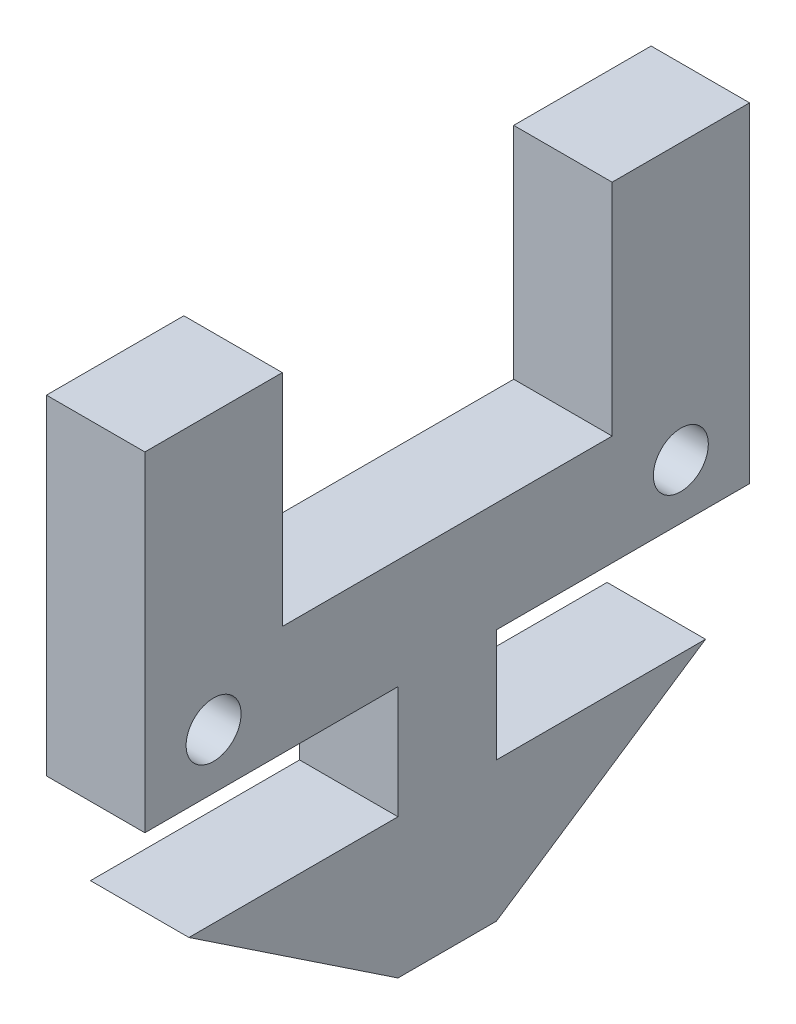
ISO-10303-21;
HEADER;
FILE_DESCRIPTION(('STEP AP214'),'2;1');
FILE_NAME('part.step','',(''),(''),'','','');
FILE_SCHEMA(('AUTOMOTIVE_DESIGN { 1 0 10303 214 1 1 1 1 }'));
ENDSEC;
DATA;
#1=APPLICATION_CONTEXT('core data for automotive mechanical design processes');
#2=APPLICATION_PROTOCOL_DEFINITION('international standard','automotive_design',2000,#1);
#3=PRODUCT_CONTEXT('',#1,'mechanical');
#4=PRODUCT('Part','Part','',(#3));
#5=PRODUCT_RELATED_PRODUCT_CATEGORY('part','',(#4));
#6=PRODUCT_DEFINITION_FORMATION('','',#4);
#7=PRODUCT_DEFINITION_CONTEXT('part definition',#1,'design');
#8=PRODUCT_DEFINITION('design','',#6,#7);
#9=PRODUCT_DEFINITION_SHAPE('','',#8);
#10=(LENGTH_UNIT() NAMED_UNIT(*) SI_UNIT(.MILLI.,.METRE.));
#11=(NAMED_UNIT(*) PLANE_ANGLE_UNIT() SI_UNIT($,.RADIAN.));
#12=(NAMED_UNIT(*) SI_UNIT($,.STERADIAN.) SOLID_ANGLE_UNIT());
#13=UNCERTAINTY_MEASURE_WITH_UNIT(LENGTH_MEASURE(1.E-05),#10,'distance_accuracy_value','');
#14=(GEOMETRIC_REPRESENTATION_CONTEXT(3) GLOBAL_UNCERTAINTY_ASSIGNED_CONTEXT((#13)) GLOBAL_UNIT_ASSIGNED_CONTEXT((#10,
#11,#12)) REPRESENTATION_CONTEXT('',''));
#15=CARTESIAN_POINT('',(0.,0.,0.));
#16=DIRECTION('',(0.,0.,1.));
#17=DIRECTION('',(1.,0.,0.));
#18=AXIS2_PLACEMENT_3D('',#15,#16,#17);
#19=CARTESIAN_POINT('',(3.5814,-6.,11.));
#20=DIRECTION('',(0.,1.,0.));
#21=DIRECTION('',(0.,0.,1.));
#22=AXIS2_PLACEMENT_3D('',#19,#20,#21);
#23=PLANE('',#22);
#24=DIRECTION('',(-1.,0.,0.));
#25=VECTOR('',#24,1.);
#26=CARTESIAN_POINT('',(24.4993830767691,-6.,1.7907));
#27=LINE('',#26,#25);
#28=CARTESIAN_POINT('',(3.5814,-6.,1.7907));
#29=VERTEX_POINT('',#28);
#30=CARTESIAN_POINT('',(0.,-6.,1.7907));
#31=VERTEX_POINT('',#30);
#32=EDGE_CURVE('E57',#29,#31,#27,.T.);
#33=ORIENTED_EDGE('',*,*,#32,.F.);
#34=DIRECTION('',(0.,0.,-1.));
#35=VECTOR('',#34,1.);
#36=CARTESIAN_POINT('',(3.5814,-6.,11.));
#37=LINE('',#36,#35);
#38=CARTESIAN_POINT('',(3.5814,-6.,11.));
#39=VERTEX_POINT('',#38);
#40=EDGE_CURVE('E231',#39,#29,#37,.T.);
#41=ORIENTED_EDGE('',*,*,#40,.F.);
#42=DIRECTION('',(-1.,0.,0.));
#43=VECTOR('',#42,1.);
#44=CARTESIAN_POINT('',(3.5814,-6.,11.));
#45=LINE('',#44,#43);
#46=CARTESIAN_POINT('',(0.,-6.,11.));
#47=VERTEX_POINT('',#46);
#48=EDGE_CURVE('E257',#39,#47,#45,.T.);
#49=ORIENTED_EDGE('',*,*,#48,.T.);
#50=DIRECTION('',(0.,0.,-1.));
#51=VECTOR('',#50,1.);
#52=CARTESIAN_POINT('',(0.,-6.,11.));
#53=LINE('',#52,#51);
#54=EDGE_CURVE('E249',#47,#31,#53,.T.);
#55=ORIENTED_EDGE('',*,*,#54,.T.);
#56=EDGE_LOOP('',(#33,#41,#49,#55));
#57=FACE_BOUND('',#56,.T.);
#58=ADVANCED_FACE('F34',(#57),#23,.F.);
#59=CARTESIAN_POINT('',(3.5814,6.,-6.));
#60=DIRECTION('',(0.,-1.,0.));
#61=DIRECTION('',(0.,0.,-1.));
#62=AXIS2_PLACEMENT_3D('',#59,#60,#61);
#63=PLANE('',#62);
#64=DIRECTION('',(0.,0.,1.));
#65=VECTOR('',#64,1.);
#66=CARTESIAN_POINT('',(0.,6.,-6.));
#67=LINE('',#66,#65);
#68=CARTESIAN_POINT('',(0.,6.,-11.));
#69=VERTEX_POINT('',#68);
#70=CARTESIAN_POINT('',(0.,6.,-6.));
#71=VERTEX_POINT('',#70);
#72=EDGE_CURVE('E212',#69,#71,#67,.T.);
#73=ORIENTED_EDGE('',*,*,#72,.T.);
#74=DIRECTION('',(-1.,0.,0.));
#75=VECTOR('',#74,1.);
#76=CARTESIAN_POINT('',(3.5814,6.,-6.));
#77=LINE('',#76,#75);
#78=CARTESIAN_POINT('',(3.5814,6.,-6.));
#79=VERTEX_POINT('',#78);
#80=EDGE_CURVE('E11',#79,#71,#77,.T.);
#81=ORIENTED_EDGE('',*,*,#80,.F.);
#82=DIRECTION('',(0.,0.,1.));
#83=VECTOR('',#82,1.);
#84=CARTESIAN_POINT('',(3.5814,6.,-6.));
#85=LINE('',#84,#83);
#86=CARTESIAN_POINT('',(3.5814,6.,-11.));
#87=VERTEX_POINT('',#86);
#88=EDGE_CURVE('E218',#87,#79,#85,.T.);
#89=ORIENTED_EDGE('',*,*,#88,.F.);
#90=DIRECTION('',(-1.,0.,0.));
#91=VECTOR('',#90,1.);
#92=CARTESIAN_POINT('',(3.5814,6.,-11.));
#93=LINE('',#92,#91);
#94=EDGE_CURVE('E235',#87,#69,#93,.T.);
#95=ORIENTED_EDGE('',*,*,#94,.T.);
#96=EDGE_LOOP('',(#73,#81,#89,#95));
#97=FACE_BOUND('',#96,.T.);
#98=ADVANCED_FACE('F36',(#97),#63,.F.);
#99=CARTESIAN_POINT('',(3.5814,-2.,-6.));
#100=DIRECTION('',(0.,0.,-1.));
#101=DIRECTION('',(0.,1.,0.));
#102=AXIS2_PLACEMENT_3D('',#99,#100,#101);
#103=PLANE('',#102);
#104=DIRECTION('',(0.,-1.,0.));
#105=VECTOR('',#104,1.);
#106=CARTESIAN_POINT('',(0.,-2.,-6.));
#107=LINE('',#106,#105);
#108=CARTESIAN_POINT('',(0.,-2.,-6.));
#109=VERTEX_POINT('',#108);
#110=EDGE_CURVE('E238',#71,#109,#107,.T.);
#111=ORIENTED_EDGE('',*,*,#110,.T.);
#112=DIRECTION('',(-1.,0.,0.));
#113=VECTOR('',#112,1.);
#114=CARTESIAN_POINT('',(3.5814,-2.,-6.));
#115=LINE('',#114,#113);
#116=CARTESIAN_POINT('',(3.5814,-2.,-6.));
#117=VERTEX_POINT('',#116);
#118=EDGE_CURVE('E42',#117,#109,#115,.T.);
#119=ORIENTED_EDGE('',*,*,#118,.F.);
#120=DIRECTION('',(0.,-1.,0.));
#121=VECTOR('',#120,1.);
#122=CARTESIAN_POINT('',(3.5814,-2.,-6.));
#123=LINE('',#122,#121);
#124=EDGE_CURVE('E220',#79,#117,#123,.T.);
#125=ORIENTED_EDGE('',*,*,#124,.F.);
#126=ORIENTED_EDGE('',*,*,#80,.T.);
#127=EDGE_LOOP('',(#111,#119,#125,#126));
#128=FACE_BOUND('',#127,.T.);
#129=ADVANCED_FACE('F294',(#128),#103,.F.);
#130=CARTESIAN_POINT('',(3.5814,-2.,6.));
#131=DIRECTION('',(0.,-1.,0.));
#132=DIRECTION('',(0.,0.,-1.));
#133=AXIS2_PLACEMENT_3D('',#130,#131,#132);
#134=PLANE('',#133);
#135=DIRECTION('',(0.,0.,1.));
#136=VECTOR('',#135,1.);
#137=CARTESIAN_POINT('',(0.,-2.,6.));
#138=LINE('',#137,#136);
#139=CARTESIAN_POINT('',(0.,-2.,6.));
#140=VERTEX_POINT('',#139);
#141=EDGE_CURVE('E240',#109,#140,#138,.T.);
#142=ORIENTED_EDGE('',*,*,#141,.T.);
#143=DIRECTION('',(-1.,0.,0.));
#144=VECTOR('',#143,1.);
#145=CARTESIAN_POINT('',(3.5814,-2.,6.));
#146=LINE('',#145,#144);
#147=CARTESIAN_POINT('',(3.5814,-2.,6.));
#148=VERTEX_POINT('',#147);
#149=EDGE_CURVE('E266',#148,#140,#146,.T.);
#150=ORIENTED_EDGE('',*,*,#149,.F.);
#151=DIRECTION('',(0.,0.,1.));
#152=VECTOR('',#151,1.);
#153=CARTESIAN_POINT('',(3.5814,-2.,6.));
#154=LINE('',#153,#152);
#155=EDGE_CURVE('E223',#117,#148,#154,.T.);
#156=ORIENTED_EDGE('',*,*,#155,.F.);
#157=ORIENTED_EDGE('',*,*,#118,.T.);
#158=EDGE_LOOP('',(#142,#150,#156,#157));
#159=FACE_BOUND('',#158,.T.);
#160=ADVANCED_FACE('F273',(#159),#134,.F.);
#161=CARTESIAN_POINT('',(3.5814,6.,6.));
#162=DIRECTION('',(0.,0.,1.));
#163=DIRECTION('',(0.,-1.,0.));
#164=AXIS2_PLACEMENT_3D('',#161,#162,#163);
#165=PLANE('',#164);
#166=DIRECTION('',(0.,1.,0.));
#167=VECTOR('',#166,1.);
#168=CARTESIAN_POINT('',(0.,6.,6.));
#169=LINE('',#168,#167);
#170=CARTESIAN_POINT('',(0.,6.,6.));
#171=VERTEX_POINT('',#170);
#172=EDGE_CURVE('E242',#140,#171,#169,.T.);
#173=ORIENTED_EDGE('',*,*,#172,.T.);
#174=DIRECTION('',(-1.,0.,0.));
#175=VECTOR('',#174,1.);
#176=CARTESIAN_POINT('',(3.5814,6.,6.));
#177=LINE('',#176,#175);
#178=CARTESIAN_POINT('',(3.5814,6.,6.));
#179=VERTEX_POINT('',#178);
#180=EDGE_CURVE('E263',#179,#171,#177,.T.);
#181=ORIENTED_EDGE('',*,*,#180,.F.);
#182=DIRECTION('',(0.,1.,0.));
#183=VECTOR('',#182,1.);
#184=CARTESIAN_POINT('',(3.5814,6.,6.));
#185=LINE('',#184,#183);
#186=EDGE_CURVE('E225',#148,#179,#185,.T.);
#187=ORIENTED_EDGE('',*,*,#186,.F.);
#188=ORIENTED_EDGE('',*,*,#149,.T.);
#189=EDGE_LOOP('',(#173,#181,#187,#188));
#190=FACE_BOUND('',#189,.T.);
#191=ADVANCED_FACE('F284',(#190),#165,.F.);
#192=CARTESIAN_POINT('',(3.5814,6.,11.));
#193=DIRECTION('',(0.,-1.,0.));
#194=DIRECTION('',(0.,0.,-1.));
#195=AXIS2_PLACEMENT_3D('',#192,#193,#194);
#196=PLANE('',#195);
#197=DIRECTION('',(0.,0.,1.));
#198=VECTOR('',#197,1.);
#199=CARTESIAN_POINT('',(0.,6.,11.));
#200=LINE('',#199,#198);
#201=CARTESIAN_POINT('',(0.,6.,11.));
#202=VERTEX_POINT('',#201);
#203=EDGE_CURVE('E244',#171,#202,#200,.T.);
#204=ORIENTED_EDGE('',*,*,#203,.T.);
#205=DIRECTION('',(-1.,0.,0.));
#206=VECTOR('',#205,1.);
#207=CARTESIAN_POINT('',(3.5814,6.,11.));
#208=LINE('',#207,#206);
#209=CARTESIAN_POINT('',(3.5814,6.,11.));
#210=VERTEX_POINT('',#209);
#211=EDGE_CURVE('E260',#210,#202,#208,.T.);
#212=ORIENTED_EDGE('',*,*,#211,.F.);
#213=DIRECTION('',(0.,0.,1.));
#214=VECTOR('',#213,1.);
#215=CARTESIAN_POINT('',(3.5814,6.,11.));
#216=LINE('',#215,#214);
#217=EDGE_CURVE('E227',#179,#210,#216,.T.);
#218=ORIENTED_EDGE('',*,*,#217,.F.);
#219=ORIENTED_EDGE('',*,*,#180,.T.);
#220=EDGE_LOOP('',(#204,#212,#218,#219));
#221=FACE_BOUND('',#220,.T.);
#222=ADVANCED_FACE('F288',(#221),#196,.F.);
#223=CARTESIAN_POINT('',(3.5814,-6.,11.));
#224=DIRECTION('',(0.,0.,-1.));
#225=DIRECTION('',(-1.,0.,0.));
#226=AXIS2_PLACEMENT_3D('',#223,#224,#225);
#227=PLANE('',#226);
#228=DIRECTION('',(0.,-1.,0.));
#229=VECTOR('',#228,1.);
#230=CARTESIAN_POINT('',(0.,-6.,11.));
#231=LINE('',#230,#229);
#232=EDGE_CURVE('E246',#202,#47,#231,.T.);
#233=ORIENTED_EDGE('',*,*,#232,.T.);
#234=ORIENTED_EDGE('',*,*,#48,.F.);
#235=DIRECTION('',(0.,-1.,0.));
#236=VECTOR('',#235,1.);
#237=CARTESIAN_POINT('',(3.5814,-6.,11.));
#238=LINE('',#237,#236);
#239=EDGE_CURVE('E229',#210,#39,#238,.T.);
#240=ORIENTED_EDGE('',*,*,#239,.F.);
#241=ORIENTED_EDGE('',*,*,#211,.T.);
#242=EDGE_LOOP('',(#233,#234,#240,#241));
#243=FACE_BOUND('',#242,.T.);
#244=ADVANCED_FACE('F334',(#243),#227,.F.);
#245=CARTESIAN_POINT('',(3.5814,-6.,-1.7907));
#246=VERTEX_POINT('',#245);
#247=CARTESIAN_POINT('',(3.5814,-6.,-11.));
#248=VERTEX_POINT('',#247);
#249=EDGE_CURVE('E49',#246,#248,#37,.T.);
#250=ORIENTED_EDGE('',*,*,#249,.F.);
#251=DIRECTION('',(-1.,0.,0.));
#252=VECTOR('',#251,1.);
#253=CARTESIAN_POINT('',(24.4993830767691,-6.,-1.7907));
#254=LINE('',#253,#252);
#255=CARTESIAN_POINT('',(0.,-6.,-1.7907));
#256=VERTEX_POINT('',#255);
#257=EDGE_CURVE('E196',#246,#256,#254,.T.);
#258=ORIENTED_EDGE('',*,*,#257,.T.);
#259=CARTESIAN_POINT('',(0.,-6.,-11.));
#260=VERTEX_POINT('',#259);
#261=EDGE_CURVE('E248',#256,#260,#53,.T.);
#262=ORIENTED_EDGE('',*,*,#261,.T.);
#263=DIRECTION('',(-1.,0.,0.));
#264=VECTOR('',#263,1.);
#265=CARTESIAN_POINT('',(3.5814,-6.,-11.));
#266=LINE('',#265,#264);
#267=EDGE_CURVE('E254',#248,#260,#266,.T.);
#268=ORIENTED_EDGE('',*,*,#267,.F.);
#269=EDGE_LOOP('',(#250,#258,#262,#268));
#270=FACE_BOUND('',#269,.T.);
#271=ADVANCED_FACE('F304',(#270),#23,.F.);
#272=CARTESIAN_POINT('',(3.5814,-6.,-11.));
#273=DIRECTION('',(0.,0.,1.));
#274=DIRECTION('',(1.,0.,0.));
#275=AXIS2_PLACEMENT_3D('',#272,#273,#274);
#276=PLANE('',#275);
#277=DIRECTION('',(0.,1.,0.));
#278=VECTOR('',#277,1.);
#279=CARTESIAN_POINT('',(0.,-6.,-11.));
#280=LINE('',#279,#278);
#281=EDGE_CURVE('E221',#260,#69,#280,.T.);
#282=ORIENTED_EDGE('',*,*,#281,.T.);
#283=ORIENTED_EDGE('',*,*,#94,.F.);
#284=DIRECTION('',(0.,1.,0.));
#285=VECTOR('',#284,1.);
#286=CARTESIAN_POINT('',(3.5814,-6.,-11.));
#287=LINE('',#286,#285);
#288=EDGE_CURVE('E233',#248,#87,#287,.T.);
#289=ORIENTED_EDGE('',*,*,#288,.F.);
#290=ORIENTED_EDGE('',*,*,#267,.T.);
#291=EDGE_LOOP('',(#282,#283,#289,#290));
#292=FACE_BOUND('',#291,.T.);
#293=ADVANCED_FACE('F302',(#292),#276,.F.);
#294=CARTESIAN_POINT('',(3.5814,0.,0.));
#295=DIRECTION('',(1.,0.,0.));
#296=DIRECTION('',(0.,0.,-1.));
#297=AXIS2_PLACEMENT_3D('',#294,#295,#296);
#298=PLANE('',#297);
#299=CARTESIAN_POINT('',(3.5814,-4.,8.5));
#300=DIRECTION('',(1.,0.,0.));
#301=DIRECTION('',(0.,0.,-1.));
#302=AXIS2_PLACEMENT_3D('',#299,#300,#301);
#303=CIRCLE('',#302,1.);
#304=CARTESIAN_POINT('',(3.5814,-4.,7.5));
#305=VERTEX_POINT('',#304);
#306=EDGE_CURVE('E213',#305,#305,#303,.T.);
#307=ORIENTED_EDGE('',*,*,#306,.F.);
#308=EDGE_LOOP('',(#307));
#309=FACE_BOUND('',#308,.T.);
#310=CARTESIAN_POINT('',(3.5814,-4.,-8.5));
#311=DIRECTION('',(1.,0.,0.));
#312=DIRECTION('',(0.,0.,-1.));
#313=AXIS2_PLACEMENT_3D('',#310,#311,#312);
#314=CIRCLE('',#313,1.);
#315=CARTESIAN_POINT('',(3.5814,-4.,-9.5));
#316=VERTEX_POINT('',#315);
#317=EDGE_CURVE('E174',#316,#316,#314,.T.);
#318=ORIENTED_EDGE('',*,*,#317,.F.);
#319=EDGE_LOOP('',(#318));
#320=FACE_BOUND('',#319,.T.);
#321=ORIENTED_EDGE('',*,*,#88,.T.);
#322=ORIENTED_EDGE('',*,*,#124,.T.);
#323=ORIENTED_EDGE('',*,*,#155,.T.);
#324=ORIENTED_EDGE('',*,*,#186,.T.);
#325=ORIENTED_EDGE('',*,*,#217,.T.);
#326=ORIENTED_EDGE('',*,*,#239,.T.);
#327=ORIENTED_EDGE('',*,*,#40,.T.);
#328=DIRECTION('',(0.,-1.,0.));
#329=VECTOR('',#328,1.);
#330=CARTESIAN_POINT('',(3.5814,-6.,1.7907));
#331=LINE('',#330,#329);
#332=CARTESIAN_POINT('',(3.5814,-10.1,1.7907));
#333=VERTEX_POINT('',#332);
#334=EDGE_CURVE('E186',#29,#333,#331,.T.);
#335=ORIENTED_EDGE('',*,*,#334,.T.);
#336=DIRECTION('',(0.,0.,1.));
#337=VECTOR('',#336,1.);
#338=CARTESIAN_POINT('',(3.5814,-10.1,1.7907));
#339=LINE('',#338,#337);
#340=CARTESIAN_POINT('',(3.5814,-10.1,9.398));
#341=VERTEX_POINT('',#340);
#342=EDGE_CURVE('E179',#333,#341,#339,.T.);
#343=ORIENTED_EDGE('',*,*,#342,.T.);
#344=DIRECTION('',(0.,-0.555340809590661,-0.831622862362014));
#345=VECTOR('',#344,1.);
#346=CARTESIAN_POINT('',(3.5814,-10.1,9.398));
#347=LINE('',#346,#345);
#348=CARTESIAN_POINT('',(3.5814,-15.18,1.7907));
#349=VERTEX_POINT('',#348);
#350=EDGE_CURVE('E173',#341,#349,#347,.T.);
#351=ORIENTED_EDGE('',*,*,#350,.T.);
#352=DIRECTION('',(0.,0.,-1.));
#353=VECTOR('',#352,1.);
#354=CARTESIAN_POINT('',(3.5814,-15.18,1.7907));
#355=LINE('',#354,#353);
#356=CARTESIAN_POINT('',(3.5814,-15.18,-1.7907));
#357=VERTEX_POINT('',#356);
#358=EDGE_CURVE('E151',#349,#357,#355,.T.);
#359=ORIENTED_EDGE('',*,*,#358,.T.);
#360=DIRECTION('',(0.,0.555340809590661,-0.831622862362014));
#361=VECTOR('',#360,1.);
#362=CARTESIAN_POINT('',(3.5814,-15.18,-1.7907));
#363=LINE('',#362,#361);
#364=CARTESIAN_POINT('',(3.5814,-10.1,-9.398));
#365=VERTEX_POINT('',#364);
#366=EDGE_CURVE('E161',#357,#365,#363,.T.);
#367=ORIENTED_EDGE('',*,*,#366,.T.);
#368=DIRECTION('',(0.,0.,1.));
#369=VECTOR('',#368,1.);
#370=CARTESIAN_POINT('',(3.5814,-10.1,-9.398));
#371=LINE('',#370,#369);
#372=CARTESIAN_POINT('',(3.5814,-10.1,-1.7907));
#373=VERTEX_POINT('',#372);
#374=EDGE_CURVE('E167',#365,#373,#371,.T.);
#375=ORIENTED_EDGE('',*,*,#374,.T.);
#376=DIRECTION('',(0.,1.,0.));
#377=VECTOR('',#376,1.);
#378=CARTESIAN_POINT('',(3.5814,-6.,-1.7907));
#379=LINE('',#378,#377);
#380=EDGE_CURVE('E189',#373,#246,#379,.T.);
#381=ORIENTED_EDGE('',*,*,#380,.T.);
#382=ORIENTED_EDGE('',*,*,#249,.T.);
#383=ORIENTED_EDGE('',*,*,#288,.T.);
#384=EDGE_LOOP('',(#321,#322,#323,#324,#325,#326,#327,#335,#343,#351,#359,#367,#375,#381,#382,#383));
#385=FACE_BOUND('',#384,.T.);
#386=ADVANCED_FACE('F171',(#309,#320,#385),#298,.T.);
#387=CARTESIAN_POINT('',(0.,0.,0.));
#388=DIRECTION('',(1.,0.,0.));
#389=DIRECTION('',(0.,0.,-1.));
#390=AXIS2_PLACEMENT_3D('',#387,#388,#389);
#391=PLANE('',#390);
#392=CARTESIAN_POINT('',(0.,-4.,8.5));
#393=DIRECTION('',(1.,0.,0.));
#394=DIRECTION('',(0.,0.,-1.));
#395=AXIS2_PLACEMENT_3D('',#392,#393,#394);
#396=CIRCLE('',#395,1.);
#397=CARTESIAN_POINT('',(0.,-4.,7.5));
#398=VERTEX_POINT('',#397);
#399=EDGE_CURVE('E209',#398,#398,#396,.T.);
#400=ORIENTED_EDGE('',*,*,#399,.T.);
#401=EDGE_LOOP('',(#400));
#402=FACE_BOUND('',#401,.T.);
#403=CARTESIAN_POINT('',(0.,-4.,-8.5));
#404=DIRECTION('',(1.,0.,0.));
#405=DIRECTION('',(0.,0.,-1.));
#406=AXIS2_PLACEMENT_3D('',#403,#404,#405);
#407=CIRCLE('',#406,1.);
#408=CARTESIAN_POINT('',(0.,-4.,-9.5));
#409=VERTEX_POINT('',#408);
#410=EDGE_CURVE('E177',#409,#409,#407,.T.);
#411=ORIENTED_EDGE('',*,*,#410,.T.);
#412=EDGE_LOOP('',(#411));
#413=FACE_BOUND('',#412,.T.);
#414=ORIENTED_EDGE('',*,*,#72,.F.);
#415=ORIENTED_EDGE('',*,*,#281,.F.);
#416=ORIENTED_EDGE('',*,*,#261,.F.);
#417=DIRECTION('',(0.,1.,0.));
#418=VECTOR('',#417,1.);
#419=CARTESIAN_POINT('',(0.,-6.,-1.7907));
#420=LINE('',#419,#418);
#421=CARTESIAN_POINT('',(0.,-10.1,-1.7907));
#422=VERTEX_POINT('',#421);
#423=EDGE_CURVE('E195',#422,#256,#420,.T.);
#424=ORIENTED_EDGE('',*,*,#423,.F.);
#425=DIRECTION('',(0.,0.,1.));
#426=VECTOR('',#425,1.);
#427=CARTESIAN_POINT('',(0.,-10.1,-9.398));
#428=LINE('',#427,#426);
#429=CARTESIAN_POINT('',(0.,-10.1,-9.398));
#430=VERTEX_POINT('',#429);
#431=EDGE_CURVE('E182',#430,#422,#428,.T.);
#432=ORIENTED_EDGE('',*,*,#431,.F.);
#433=DIRECTION('',(0.,0.555340809590661,-0.831622862362014));
#434=VECTOR('',#433,1.);
#435=CARTESIAN_POINT('',(0.,-15.18,-1.7907));
#436=LINE('',#435,#434);
#437=CARTESIAN_POINT('',(0.,-15.18,-1.7907));
#438=VERTEX_POINT('',#437);
#439=EDGE_CURVE('E158',#438,#430,#436,.T.);
#440=ORIENTED_EDGE('',*,*,#439,.F.);
#441=DIRECTION('',(0.,0.,-1.));
#442=VECTOR('',#441,1.);
#443=CARTESIAN_POINT('',(0.,-15.18,1.7907));
#444=LINE('',#443,#442);
#445=CARTESIAN_POINT('',(0.,-15.18,1.7907));
#446=VERTEX_POINT('',#445);
#447=EDGE_CURVE('E154',#446,#438,#444,.T.);
#448=ORIENTED_EDGE('',*,*,#447,.F.);
#449=DIRECTION('',(0.,-0.555340809590661,-0.831622862362014));
#450=VECTOR('',#449,1.);
#451=CARTESIAN_POINT('',(0.,-10.1,9.398));
#452=LINE('',#451,#450);
#453=CARTESIAN_POINT('',(0.,-10.1,9.398));
#454=VERTEX_POINT('',#453);
#455=EDGE_CURVE('E205',#454,#446,#452,.T.);
#456=ORIENTED_EDGE('',*,*,#455,.F.);
#457=DIRECTION('',(0.,0.,1.));
#458=VECTOR('',#457,1.);
#459=CARTESIAN_POINT('',(0.,-10.1,1.7907));
#460=LINE('',#459,#458);
#461=CARTESIAN_POINT('',(0.,-10.1,1.7907));
#462=VERTEX_POINT('',#461);
#463=EDGE_CURVE('E202',#462,#454,#460,.T.);
#464=ORIENTED_EDGE('',*,*,#463,.F.);
#465=DIRECTION('',(0.,-1.,0.));
#466=VECTOR('',#465,1.);
#467=CARTESIAN_POINT('',(0.,-6.,1.7907));
#468=LINE('',#467,#466);
#469=EDGE_CURVE('E199',#31,#462,#468,.T.);
#470=ORIENTED_EDGE('',*,*,#469,.F.);
#471=ORIENTED_EDGE('',*,*,#54,.F.);
#472=ORIENTED_EDGE('',*,*,#232,.F.);
#473=ORIENTED_EDGE('',*,*,#203,.F.);
#474=ORIENTED_EDGE('',*,*,#172,.F.);
#475=ORIENTED_EDGE('',*,*,#141,.F.);
#476=ORIENTED_EDGE('',*,*,#110,.F.);
#477=EDGE_LOOP('',(#414,#415,#416,#424,#432,#440,#448,#456,#464,#470,#471,#472,#473,#474,#475,#476));
#478=FACE_BOUND('',#477,.T.);
#479=ADVANCED_FACE('F279',(#402,#413,#478),#391,.F.);
#480=CARTESIAN_POINT('',(0.,-4.,-8.5));
#481=DIRECTION('',(1.,0.,0.));
#482=DIRECTION('',(0.,0.,-1.));
#483=AXIS2_PLACEMENT_3D('',#480,#481,#482);
#484=CYLINDRICAL_SURFACE('',#483,1.);
#485=ORIENTED_EDGE('',*,*,#410,.F.);
#486=EDGE_LOOP('',(#485));
#487=FACE_BOUND('',#486,.T.);
#488=ORIENTED_EDGE('',*,*,#317,.T.);
#489=EDGE_LOOP('',(#488));
#490=FACE_BOUND('',#489,.T.);
#491=ADVANCED_FACE('F352',(#487,#490),#484,.F.);
#492=CARTESIAN_POINT('',(0.,-4.,8.5));
#493=DIRECTION('',(1.,0.,0.));
#494=DIRECTION('',(0.,0.,-1.));
#495=AXIS2_PLACEMENT_3D('',#492,#493,#494);
#496=CYLINDRICAL_SURFACE('',#495,1.);
#497=ORIENTED_EDGE('',*,*,#399,.F.);
#498=EDGE_LOOP('',(#497));
#499=FACE_BOUND('',#498,.T.);
#500=ORIENTED_EDGE('',*,*,#306,.T.);
#501=EDGE_LOOP('',(#500));
#502=FACE_BOUND('',#501,.T.);
#503=ADVANCED_FACE('F359',(#499,#502),#496,.F.);
#504=CARTESIAN_POINT('',(24.4993830767691,-10.1,-9.398));
#505=DIRECTION('',(0.,-1.,0.));
#506=DIRECTION('',(0.,0.,-1.));
#507=AXIS2_PLACEMENT_3D('',#504,#505,#506);
#508=PLANE('',#507);
#509=ORIENTED_EDGE('',*,*,#374,.F.);
#510=DIRECTION('',(-1.,0.,0.));
#511=VECTOR('',#510,1.);
#512=CARTESIAN_POINT('',(24.4993830767691,-10.1,-9.398));
#513=LINE('',#512,#511);
#514=EDGE_CURVE('E163',#365,#430,#513,.T.);
#515=ORIENTED_EDGE('',*,*,#514,.T.);
#516=ORIENTED_EDGE('',*,*,#431,.T.);
#517=DIRECTION('',(-1.,0.,0.));
#518=VECTOR('',#517,1.);
#519=CARTESIAN_POINT('',(24.4993830767691,-10.1,-1.7907));
#520=LINE('',#519,#518);
#521=EDGE_CURVE('E193',#373,#422,#520,.T.);
#522=ORIENTED_EDGE('',*,*,#521,.F.);
#523=EDGE_LOOP('',(#509,#515,#516,#522));
#524=FACE_BOUND('',#523,.T.);
#525=ADVANCED_FACE('F309',(#524),#508,.F.);
#526=CARTESIAN_POINT('',(24.4993830767691,-6.,-1.7907));
#527=DIRECTION('',(0.,0.,1.));
#528=DIRECTION('',(0.,-1.,0.));
#529=AXIS2_PLACEMENT_3D('',#526,#527,#528);
#530=PLANE('',#529);
#531=ORIENTED_EDGE('',*,*,#380,.F.);
#532=ORIENTED_EDGE('',*,*,#521,.T.);
#533=ORIENTED_EDGE('',*,*,#423,.T.);
#534=ORIENTED_EDGE('',*,*,#257,.F.);
#535=EDGE_LOOP('',(#531,#532,#533,#534));
#536=FACE_BOUND('',#535,.T.);
#537=ADVANCED_FACE('F306',(#536),#530,.F.);
#538=CARTESIAN_POINT('',(24.4993830767691,-6.,1.7907));
#539=DIRECTION('',(0.,0.,-1.));
#540=DIRECTION('',(0.,1.,0.));
#541=AXIS2_PLACEMENT_3D('',#538,#539,#540);
#542=PLANE('',#541);
#543=ORIENTED_EDGE('',*,*,#334,.F.);
#544=ORIENTED_EDGE('',*,*,#32,.T.);
#545=ORIENTED_EDGE('',*,*,#469,.T.);
#546=DIRECTION('',(-1.,0.,0.));
#547=VECTOR('',#546,1.);
#548=CARTESIAN_POINT('',(24.4993830767691,-10.1,1.7907));
#549=LINE('',#548,#547);
#550=EDGE_CURVE('E200',#333,#462,#549,.T.);
#551=ORIENTED_EDGE('',*,*,#550,.F.);
#552=EDGE_LOOP('',(#543,#544,#545,#551));
#553=FACE_BOUND('',#552,.T.);
#554=ADVANCED_FACE('F331',(#553),#542,.F.);
#555=CARTESIAN_POINT('',(24.4993830767691,-10.1,1.7907));
#556=DIRECTION('',(0.,-1.,0.));
#557=DIRECTION('',(0.,0.,-1.));
#558=AXIS2_PLACEMENT_3D('',#555,#556,#557);
#559=PLANE('',#558);
#560=ORIENTED_EDGE('',*,*,#342,.F.);
#561=ORIENTED_EDGE('',*,*,#550,.T.);
#562=ORIENTED_EDGE('',*,*,#463,.T.);
#563=DIRECTION('',(-1.,0.,0.));
#564=VECTOR('',#563,1.);
#565=CARTESIAN_POINT('',(24.4993830767691,-10.1,9.398));
#566=LINE('',#565,#564);
#567=EDGE_CURVE('E203',#341,#454,#566,.T.);
#568=ORIENTED_EDGE('',*,*,#567,.F.);
#569=EDGE_LOOP('',(#560,#561,#562,#568));
#570=FACE_BOUND('',#569,.T.);
#571=ADVANCED_FACE('F327',(#570),#559,.F.);
#572=CARTESIAN_POINT('',(24.4993830767691,-10.1,9.398));
#573=DIRECTION('',(0.,0.831622862362014,-0.555340809590661));
#574=DIRECTION('',(0.,0.555340809590661,0.831622862362014));
#575=AXIS2_PLACEMENT_3D('',#572,#573,#574);
#576=PLANE('',#575);
#577=ORIENTED_EDGE('',*,*,#350,.F.);
#578=ORIENTED_EDGE('',*,*,#567,.T.);
#579=ORIENTED_EDGE('',*,*,#455,.T.);
#580=DIRECTION('',(-1.,0.,0.));
#581=VECTOR('',#580,1.);
#582=CARTESIAN_POINT('',(24.4993830767691,-15.18,1.7907));
#583=LINE('',#582,#581);
#584=EDGE_CURVE('E206',#349,#446,#583,.T.);
#585=ORIENTED_EDGE('',*,*,#584,.F.);
#586=EDGE_LOOP('',(#577,#578,#579,#585));
#587=FACE_BOUND('',#586,.T.);
#588=ADVANCED_FACE('F324',(#587),#576,.F.);
#589=CARTESIAN_POINT('',(24.4993830767691,-15.18,1.7907));
#590=DIRECTION('',(0.,1.,0.));
#591=DIRECTION('',(0.,0.,1.));
#592=AXIS2_PLACEMENT_3D('',#589,#590,#591);
#593=PLANE('',#592);
#594=ORIENTED_EDGE('',*,*,#358,.F.);
#595=ORIENTED_EDGE('',*,*,#584,.T.);
#596=ORIENTED_EDGE('',*,*,#447,.T.);
#597=DIRECTION('',(-1.,0.,0.));
#598=VECTOR('',#597,1.);
#599=CARTESIAN_POINT('',(24.4993830767691,-15.18,-1.7907));
#600=LINE('',#599,#598);
#601=EDGE_CURVE('E147',#357,#438,#600,.T.);
#602=ORIENTED_EDGE('',*,*,#601,.F.);
#603=EDGE_LOOP('',(#594,#595,#596,#602));
#604=FACE_BOUND('',#603,.T.);
#605=ADVANCED_FACE('F149',(#604),#593,.F.);
#606=CARTESIAN_POINT('',(24.4993830767691,-15.18,-1.7907));
#607=DIRECTION('',(0.,0.831622862362014,0.555340809590661));
#608=DIRECTION('',(0.,-0.555340809590661,0.831622862362014));
#609=AXIS2_PLACEMENT_3D('',#606,#607,#608);
#610=PLANE('',#609);
#611=ORIENTED_EDGE('',*,*,#366,.F.);
#612=ORIENTED_EDGE('',*,*,#601,.T.);
#613=ORIENTED_EDGE('',*,*,#439,.T.);
#614=ORIENTED_EDGE('',*,*,#514,.F.);
#615=EDGE_LOOP('',(#611,#612,#613,#614));
#616=FACE_BOUND('',#615,.T.);
#617=ADVANCED_FACE('F162',(#616),#610,.F.);
#618=CLOSED_SHELL('',(#58,#98,#129,#160,#191,#222,#244,#271,#293,#386,#479,#491,#503,#525,#537,
#554,#571,#588,#605,#617));
#619=MANIFOLD_SOLID_BREP('B2',#618);
#620=ADVANCED_BREP_SHAPE_REPRESENTATION('',(#18,#619),#14);
#621=SHAPE_DEFINITION_REPRESENTATION(#9,#620);
ENDSEC;
END-ISO-10303-21;
